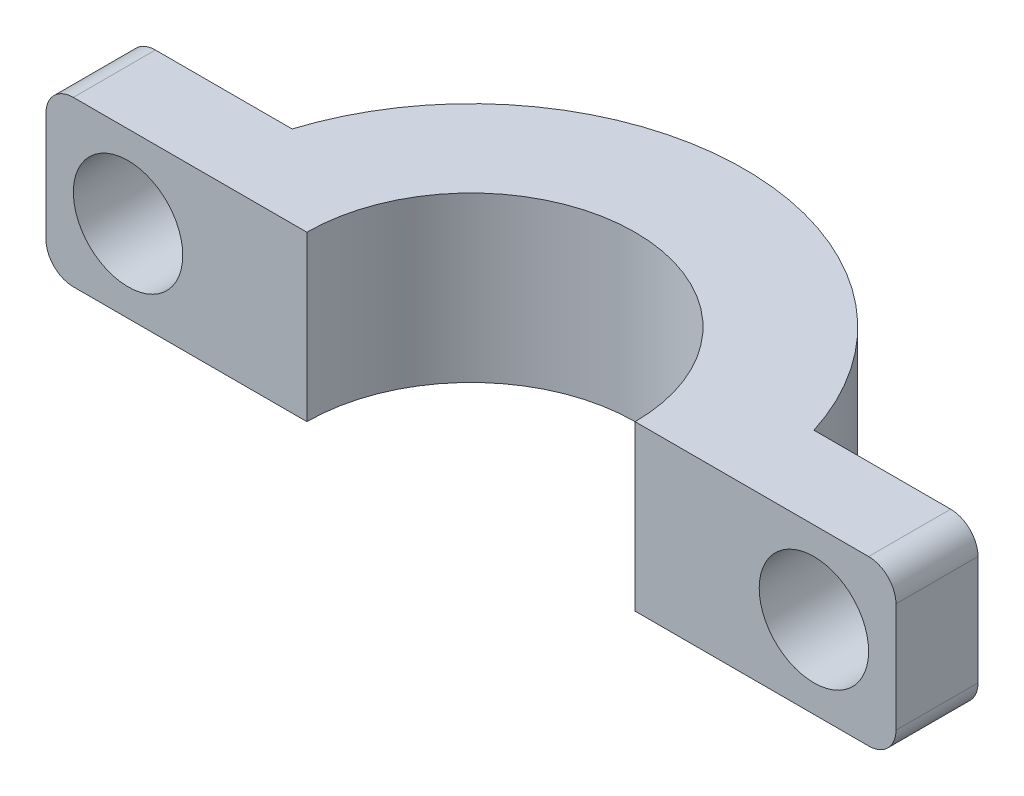
ISO-10303-21;
HEADER;
FILE_DESCRIPTION(('STEP AP214'),'2;1');
FILE_NAME('part.step','',(''),(''),'','','');
FILE_SCHEMA(('AUTOMOTIVE_DESIGN { 1 0 10303 214 1 1 1 1 }'));
ENDSEC;
DATA;
#1=APPLICATION_CONTEXT('core data for automotive mechanical design processes');
#2=APPLICATION_PROTOCOL_DEFINITION('international standard','automotive_design',2000,#1);
#3=PRODUCT_CONTEXT('',#1,'mechanical');
#4=PRODUCT('Part','Part','',(#3));
#5=PRODUCT_RELATED_PRODUCT_CATEGORY('part','',(#4));
#6=PRODUCT_DEFINITION_FORMATION('','',#4);
#7=PRODUCT_DEFINITION_CONTEXT('part definition',#1,'design');
#8=PRODUCT_DEFINITION('design','',#6,#7);
#9=PRODUCT_DEFINITION_SHAPE('','',#8);
#10=(LENGTH_UNIT() NAMED_UNIT(*) SI_UNIT(.MILLI.,.METRE.));
#11=(NAMED_UNIT(*) PLANE_ANGLE_UNIT() SI_UNIT($,.RADIAN.));
#12=(NAMED_UNIT(*) SI_UNIT($,.STERADIAN.) SOLID_ANGLE_UNIT());
#13=UNCERTAINTY_MEASURE_WITH_UNIT(LENGTH_MEASURE(1.E-05),#10,'distance_accuracy_value','');
#14=(GEOMETRIC_REPRESENTATION_CONTEXT(3) GLOBAL_UNCERTAINTY_ASSIGNED_CONTEXT((#13)) GLOBAL_UNIT_ASSIGNED_CONTEXT((#10,
#11,#12)) REPRESENTATION_CONTEXT('',''));
#15=CARTESIAN_POINT('',(0.,0.,0.));
#16=DIRECTION('',(0.,0.,1.));
#17=DIRECTION('',(1.,0.,0.));
#18=AXIS2_PLACEMENT_3D('',#15,#16,#17);
#19=CARTESIAN_POINT('',(0.,6.,0.));
#20=DIRECTION('',(0.,-1.,0.));
#21=DIRECTION('',(0.,0.,-1.));
#22=AXIS2_PLACEMENT_3D('',#19,#20,#21);
#23=CYLINDRICAL_SURFACE('',#22,10.);
#24=DIRECTION('',(0.,1.,0.));
#25=VECTOR('',#24,1.);
#26=CARTESIAN_POINT('',(9.53939201416946,-6.70820393249937,-3.));
#27=LINE('',#26,#25);
#28=CARTESIAN_POINT('',(9.53939201416946,0.,-3.));
#29=VERTEX_POINT('',#28);
#30=CARTESIAN_POINT('',(9.53939201416946,6.,-3.));
#31=VERTEX_POINT('',#30);
#32=EDGE_CURVE('E148',#29,#31,#27,.T.);
#33=ORIENTED_EDGE('',*,*,#32,.F.);
#34=CARTESIAN_POINT('',(0.,0.,0.));
#35=DIRECTION('',(0.,1.,0.));
#36=DIRECTION('',(0.,0.,-1.));
#37=AXIS2_PLACEMENT_3D('',#34,#35,#36);
#38=CIRCLE('',#37,10.);
#39=CARTESIAN_POINT('',(-9.53939201416946,0.,-3.));
#40=VERTEX_POINT('',#39);
#41=EDGE_CURVE('E131',#29,#40,#38,.T.);
#42=ORIENTED_EDGE('',*,*,#41,.T.);
#43=DIRECTION('',(0.,1.,0.));
#44=VECTOR('',#43,1.);
#45=CARTESIAN_POINT('',(-9.53939201416946,-6.70820393249937,-3.));
#46=LINE('',#45,#44);
#47=CARTESIAN_POINT('',(-9.53939201416946,6.,-3.));
#48=VERTEX_POINT('',#47);
#49=EDGE_CURVE('E177',#40,#48,#46,.T.);
#50=ORIENTED_EDGE('',*,*,#49,.T.);
#51=CARTESIAN_POINT('',(0.,6.,0.));
#52=DIRECTION('',(0.,1.,0.));
#53=DIRECTION('',(0.,0.,-1.));
#54=AXIS2_PLACEMENT_3D('',#51,#52,#53);
#55=CIRCLE('',#54,10.);
#56=EDGE_CURVE('E149',#31,#48,#55,.T.);
#57=ORIENTED_EDGE('',*,*,#56,.F.);
#58=EDGE_LOOP('',(#33,#42,#50,#57));
#59=FACE_BOUND('',#58,.T.);
#60=ADVANCED_FACE('F42',(#59),#23,.T.);
#61=CARTESIAN_POINT('',(0.,6.,0.));
#62=DIRECTION('',(0.,-1.,0.));
#63=DIRECTION('',(0.,0.,-1.));
#64=AXIS2_PLACEMENT_3D('',#61,#62,#63);
#65=CYLINDRICAL_SURFACE('',#64,6.);
#66=CARTESIAN_POINT('',(0.,0.,0.));
#67=DIRECTION('',(0.,-1.,0.));
#68=DIRECTION('',(0.,0.,-1.));
#69=AXIS2_PLACEMENT_3D('',#66,#67,#68);
#70=CIRCLE('',#69,6.);
#71=CARTESIAN_POINT('',(-6.,0.,0.));
#72=VERTEX_POINT('',#71);
#73=CARTESIAN_POINT('',(6.,0.,0.));
#74=VERTEX_POINT('',#73);
#75=EDGE_CURVE('E181',#72,#74,#70,.T.);
#76=ORIENTED_EDGE('',*,*,#75,.T.);
#77=DIRECTION('',(0.,-1.,0.));
#78=VECTOR('',#77,1.);
#79=CARTESIAN_POINT('',(6.,6.,0.));
#80=LINE('',#79,#78);
#81=CARTESIAN_POINT('',(6.,6.,0.));
#82=VERTEX_POINT('',#81);
#83=EDGE_CURVE('E199',#82,#74,#80,.T.);
#84=ORIENTED_EDGE('',*,*,#83,.F.);
#85=CARTESIAN_POINT('',(0.,6.,0.));
#86=DIRECTION('',(0.,-1.,0.));
#87=DIRECTION('',(0.,0.,-1.));
#88=AXIS2_PLACEMENT_3D('',#85,#86,#87);
#89=CIRCLE('',#88,6.);
#90=CARTESIAN_POINT('',(-6.,6.,0.));
#91=VERTEX_POINT('',#90);
#92=EDGE_CURVE('E182',#91,#82,#89,.T.);
#93=ORIENTED_EDGE('',*,*,#92,.F.);
#94=DIRECTION('',(0.,-1.,0.));
#95=VECTOR('',#94,1.);
#96=CARTESIAN_POINT('',(-6.,6.,0.));
#97=LINE('',#96,#95);
#98=EDGE_CURVE('E191',#91,#72,#97,.T.);
#99=ORIENTED_EDGE('',*,*,#98,.T.);
#100=EDGE_LOOP('',(#76,#84,#93,#99));
#101=FACE_BOUND('',#100,.T.);
#102=ADVANCED_FACE('F247',(#101),#65,.F.);
#103=CARTESIAN_POINT('',(6.,6.,0.));
#104=DIRECTION('',(0.,0.,-1.));
#105=DIRECTION('',(-1.,0.,0.));
#106=AXIS2_PLACEMENT_3D('',#103,#104,#105);
#107=PLANE('',#106);
#108=CARTESIAN_POINT('',(12.5393920141695,3.,0.));
#109=DIRECTION('',(0.,0.,-1.));
#110=DIRECTION('',(-1.,0.,0.));
#111=AXIS2_PLACEMENT_3D('',#108,#109,#110);
#112=CIRCLE('',#111,2.);
#113=CARTESIAN_POINT('',(10.5393920141695,3.,0.));
#114=VERTEX_POINT('',#113);
#115=EDGE_CURVE('E207',#114,#114,#112,.T.);
#116=ORIENTED_EDGE('',*,*,#115,.T.);
#117=EDGE_LOOP('',(#116));
#118=FACE_BOUND('',#117,.T.);
#119=DIRECTION('',(1.,0.,0.));
#120=VECTOR('',#119,1.);
#121=CARTESIAN_POINT('',(6.,0.,0.));
#122=LINE('',#121,#120);
#123=CARTESIAN_POINT('',(14.5393920141695,0.,0.));
#124=VERTEX_POINT('',#123);
#125=EDGE_CURVE('E145',#74,#124,#122,.T.);
#126=ORIENTED_EDGE('',*,*,#125,.T.);
#127=CARTESIAN_POINT('',(14.5393920141695,1.,0.));
#128=DIRECTION('',(0.,0.,-1.));
#129=DIRECTION('',(-1.,0.,0.));
#130=AXIS2_PLACEMENT_3D('',#127,#128,#129);
#131=CIRCLE('',#130,1.);
#132=CARTESIAN_POINT('',(15.5393920141695,1.,0.));
#133=VERTEX_POINT('',#132);
#134=EDGE_CURVE('E231',#124,#133,#131,.F.);
#135=ORIENTED_EDGE('',*,*,#134,.T.);
#136=DIRECTION('',(0.,1.,0.));
#137=VECTOR('',#136,1.);
#138=CARTESIAN_POINT('',(15.5393920141695,-6.70820393249937,0.));
#139=LINE('',#138,#137);
#140=CARTESIAN_POINT('',(15.5393920141695,5.,0.));
#141=VERTEX_POINT('',#140);
#142=EDGE_CURVE('E157',#133,#141,#139,.T.);
#143=ORIENTED_EDGE('',*,*,#142,.T.);
#144=CARTESIAN_POINT('',(14.5393920141695,5.,0.));
#145=DIRECTION('',(0.,0.,-1.));
#146=DIRECTION('',(-1.,0.,0.));
#147=AXIS2_PLACEMENT_3D('',#144,#145,#146);
#148=CIRCLE('',#147,1.);
#149=CARTESIAN_POINT('',(14.5393920141695,6.,0.));
#150=VERTEX_POINT('',#149);
#151=EDGE_CURVE('E229',#141,#150,#148,.F.);
#152=ORIENTED_EDGE('',*,*,#151,.T.);
#153=DIRECTION('',(1.,0.,0.));
#154=VECTOR('',#153,1.);
#155=CARTESIAN_POINT('',(6.,6.,0.));
#156=LINE('',#155,#154);
#157=EDGE_CURVE('E185',#82,#150,#156,.T.);
#158=ORIENTED_EDGE('',*,*,#157,.F.);
#159=ORIENTED_EDGE('',*,*,#83,.T.);
#160=EDGE_LOOP('',(#126,#135,#143,#152,#158,#159));
#161=FACE_BOUND('',#160,.T.);
#162=ADVANCED_FACE('F240',(#118,#161),#107,.F.);
#163=CARTESIAN_POINT('',(-10.,6.,0.));
#164=DIRECTION('',(0.,0.,-1.));
#165=DIRECTION('',(-1.,0.,0.));
#166=AXIS2_PLACEMENT_3D('',#163,#164,#165);
#167=PLANE('',#166);
#168=CARTESIAN_POINT('',(-12.5393920141695,3.,0.));
#169=DIRECTION('',(0.,0.,1.));
#170=DIRECTION('',(1.,0.,0.));
#171=AXIS2_PLACEMENT_3D('',#168,#169,#170);
#172=CIRCLE('',#171,2.);
#173=CARTESIAN_POINT('',(-10.5393920141695,3.,0.));
#174=VERTEX_POINT('',#173);
#175=EDGE_CURVE('E156',#174,#174,#172,.T.);
#176=ORIENTED_EDGE('',*,*,#175,.F.);
#177=EDGE_LOOP('',(#176));
#178=FACE_BOUND('',#177,.T.);
#179=DIRECTION('',(0.,1.,0.));
#180=VECTOR('',#179,1.);
#181=CARTESIAN_POINT('',(-15.5393920141695,-6.70820393249937,0.));
#182=LINE('',#181,#180);
#183=CARTESIAN_POINT('',(-15.5393920141695,1.,0.));
#184=VERTEX_POINT('',#183);
#185=CARTESIAN_POINT('',(-15.5393920141695,5.,0.));
#186=VERTEX_POINT('',#185);
#187=EDGE_CURVE('E174',#184,#186,#182,.T.);
#188=ORIENTED_EDGE('',*,*,#187,.F.);
#189=CARTESIAN_POINT('',(-14.5393920141695,1.,0.));
#190=DIRECTION('',(0.,0.,-1.));
#191=DIRECTION('',(-1.,0.,0.));
#192=AXIS2_PLACEMENT_3D('',#189,#190,#191);
#193=CIRCLE('',#192,1.);
#194=CARTESIAN_POINT('',(-14.5393920141695,0.,0.));
#195=VERTEX_POINT('',#194);
#196=EDGE_CURVE('E214',#184,#195,#193,.F.);
#197=ORIENTED_EDGE('',*,*,#196,.T.);
#198=DIRECTION('',(1.,0.,0.));
#199=VECTOR('',#198,1.);
#200=CARTESIAN_POINT('',(-10.,0.,0.));
#201=LINE('',#200,#199);
#202=EDGE_CURVE('E144',#195,#72,#201,.T.);
#203=ORIENTED_EDGE('',*,*,#202,.T.);
#204=ORIENTED_EDGE('',*,*,#98,.F.);
#205=DIRECTION('',(1.,0.,0.));
#206=VECTOR('',#205,1.);
#207=CARTESIAN_POINT('',(-10.,6.,0.));
#208=LINE('',#207,#206);
#209=CARTESIAN_POINT('',(-14.5393920141695,6.,0.));
#210=VERTEX_POINT('',#209);
#211=EDGE_CURVE('E189',#210,#91,#208,.T.);
#212=ORIENTED_EDGE('',*,*,#211,.F.);
#213=CARTESIAN_POINT('',(-14.5393920141695,5.,0.));
#214=DIRECTION('',(0.,0.,-1.));
#215=DIRECTION('',(-1.,0.,0.));
#216=AXIS2_PLACEMENT_3D('',#213,#214,#215);
#217=CIRCLE('',#216,1.);
#218=EDGE_CURVE('E212',#210,#186,#217,.F.);
#219=ORIENTED_EDGE('',*,*,#218,.T.);
#220=EDGE_LOOP('',(#188,#197,#203,#204,#212,#219));
#221=FACE_BOUND('',#220,.T.);
#222=ADVANCED_FACE('F252',(#178,#221),#167,.F.);
#223=CARTESIAN_POINT('',(0.,6.,0.));
#224=DIRECTION('',(0.,-1.,0.));
#225=DIRECTION('',(0.,0.,-1.));
#226=AXIS2_PLACEMENT_3D('',#223,#224,#225);
#227=PLANE('',#226);
#228=DIRECTION('',(-1.,0.,0.));
#229=VECTOR('',#228,1.);
#230=CARTESIAN_POINT('',(-15.5393920141695,6.,-3.));
#231=LINE('',#230,#229);
#232=CARTESIAN_POINT('',(-14.5393920141695,6.,-3.));
#233=VERTEX_POINT('',#232);
#234=EDGE_CURVE('E169',#48,#233,#231,.T.);
#235=ORIENTED_EDGE('',*,*,#234,.T.);
#236=DIRECTION('',(0.,0.,1.));
#237=VECTOR('',#236,1.);
#238=CARTESIAN_POINT('',(-14.5393920141695,6.,0.));
#239=LINE('',#238,#237);
#240=EDGE_CURVE('E226',#233,#210,#239,.T.);
#241=ORIENTED_EDGE('',*,*,#240,.T.);
#242=ORIENTED_EDGE('',*,*,#211,.T.);
#243=ORIENTED_EDGE('',*,*,#92,.T.);
#244=ORIENTED_EDGE('',*,*,#157,.T.);
#245=DIRECTION('',(0.,0.,1.));
#246=VECTOR('',#245,1.);
#247=CARTESIAN_POINT('',(14.5393920141695,6.,0.));
#248=LINE('',#247,#246);
#249=CARTESIAN_POINT('',(14.5393920141695,6.,-3.));
#250=VERTEX_POINT('',#249);
#251=EDGE_CURVE('E224',#150,#250,#248,.F.);
#252=ORIENTED_EDGE('',*,*,#251,.T.);
#253=DIRECTION('',(1.,0.,0.));
#254=VECTOR('',#253,1.);
#255=CARTESIAN_POINT('',(15.5393920141695,6.,-3.));
#256=LINE('',#255,#254);
#257=EDGE_CURVE('E151',#31,#250,#256,.T.);
#258=ORIENTED_EDGE('',*,*,#257,.F.);
#259=ORIENTED_EDGE('',*,*,#56,.T.);
#260=EDGE_LOOP('',(#235,#241,#242,#243,#244,#252,#258,#259));
#261=FACE_BOUND('',#260,.T.);
#262=ADVANCED_FACE('F270',(#261),#227,.F.);
#263=CARTESIAN_POINT('',(0.,0.,0.));
#264=DIRECTION('',(0.,-1.,0.));
#265=DIRECTION('',(0.,0.,-1.));
#266=AXIS2_PLACEMENT_3D('',#263,#264,#265);
#267=PLANE('',#266);
#268=ORIENTED_EDGE('',*,*,#202,.F.);
#269=DIRECTION('',(0.,0.,1.));
#270=VECTOR('',#269,1.);
#271=CARTESIAN_POINT('',(-14.5393920141695,0.,0.));
#272=LINE('',#271,#270);
#273=CARTESIAN_POINT('',(-14.5393920141695,0.,-3.));
#274=VERTEX_POINT('',#273);
#275=EDGE_CURVE('E218',#195,#274,#272,.F.);
#276=ORIENTED_EDGE('',*,*,#275,.T.);
#277=DIRECTION('',(-1.,0.,0.));
#278=VECTOR('',#277,1.);
#279=CARTESIAN_POINT('',(-15.5393920141695,0.,-3.));
#280=LINE('',#279,#278);
#281=EDGE_CURVE('E140',#40,#274,#280,.T.);
#282=ORIENTED_EDGE('',*,*,#281,.F.);
#283=ORIENTED_EDGE('',*,*,#41,.F.);
#284=DIRECTION('',(1.,0.,0.));
#285=VECTOR('',#284,1.);
#286=CARTESIAN_POINT('',(15.5393920141695,0.,-3.));
#287=LINE('',#286,#285);
#288=CARTESIAN_POINT('',(14.5393920141695,0.,-3.));
#289=VERTEX_POINT('',#288);
#290=EDGE_CURVE('E137',#29,#289,#287,.T.);
#291=ORIENTED_EDGE('',*,*,#290,.T.);
#292=DIRECTION('',(0.,0.,1.));
#293=VECTOR('',#292,1.);
#294=CARTESIAN_POINT('',(14.5393920141695,0.,0.));
#295=LINE('',#294,#293);
#296=EDGE_CURVE('E216',#289,#124,#295,.T.);
#297=ORIENTED_EDGE('',*,*,#296,.T.);
#298=ORIENTED_EDGE('',*,*,#125,.F.);
#299=ORIENTED_EDGE('',*,*,#75,.F.);
#300=EDGE_LOOP('',(#268,#276,#282,#283,#291,#297,#298,#299));
#301=FACE_BOUND('',#300,.T.);
#302=ADVANCED_FACE('F134',(#301),#267,.T.);
#303=CARTESIAN_POINT('',(-15.5393920141695,-6.70820393249937,-3.));
#304=DIRECTION('',(0.,0.,-1.));
#305=DIRECTION('',(-1.,0.,0.));
#306=AXIS2_PLACEMENT_3D('',#303,#304,#305);
#307=PLANE('',#306);
#308=CARTESIAN_POINT('',(-12.5393920141695,3.,-3.));
#309=DIRECTION('',(0.,0.,-1.));
#310=DIRECTION('',(-1.,0.,0.));
#311=AXIS2_PLACEMENT_3D('',#308,#309,#310);
#312=CIRCLE('',#311,2.);
#313=CARTESIAN_POINT('',(-14.5393920141695,3.,-3.));
#314=VERTEX_POINT('',#313);
#315=EDGE_CURVE('E160',#314,#314,#312,.T.);
#316=ORIENTED_EDGE('',*,*,#315,.F.);
#317=EDGE_LOOP('',(#316));
#318=FACE_BOUND('',#317,.T.);
#319=ORIENTED_EDGE('',*,*,#281,.T.);
#320=CARTESIAN_POINT('',(-14.5393920141695,1.,-3.));
#321=DIRECTION('',(0.,0.,-1.));
#322=DIRECTION('',(-1.,0.,0.));
#323=AXIS2_PLACEMENT_3D('',#320,#321,#322);
#324=CIRCLE('',#323,1.);
#325=CARTESIAN_POINT('',(-15.5393920141695,1.,-3.));
#326=VERTEX_POINT('',#325);
#327=EDGE_CURVE('E222',#274,#326,#324,.T.);
#328=ORIENTED_EDGE('',*,*,#327,.T.);
#329=DIRECTION('',(0.,1.,0.));
#330=VECTOR('',#329,1.);
#331=CARTESIAN_POINT('',(-15.5393920141695,-6.70820393249937,-3.));
#332=LINE('',#331,#330);
#333=CARTESIAN_POINT('',(-15.5393920141695,5.,-3.));
#334=VERTEX_POINT('',#333);
#335=EDGE_CURVE('E173',#326,#334,#332,.T.);
#336=ORIENTED_EDGE('',*,*,#335,.T.);
#337=CARTESIAN_POINT('',(-14.5393920141695,5.,-3.));
#338=DIRECTION('',(0.,0.,-1.));
#339=DIRECTION('',(-1.,0.,0.));
#340=AXIS2_PLACEMENT_3D('',#337,#338,#339);
#341=CIRCLE('',#340,1.);
#342=EDGE_CURVE('E220',#334,#233,#341,.T.);
#343=ORIENTED_EDGE('',*,*,#342,.T.);
#344=ORIENTED_EDGE('',*,*,#234,.F.);
#345=ORIENTED_EDGE('',*,*,#49,.F.);
#346=EDGE_LOOP('',(#319,#328,#336,#343,#344,#345));
#347=FACE_BOUND('',#346,.T.);
#348=ADVANCED_FACE('F260',(#318,#347),#307,.T.);
#349=CARTESIAN_POINT('',(-15.5393920141695,-6.70820393249937,0.));
#350=DIRECTION('',(-1.,0.,0.));
#351=DIRECTION('',(0.,0.,1.));
#352=AXIS2_PLACEMENT_3D('',#349,#350,#351);
#353=PLANE('',#352);
#354=ORIENTED_EDGE('',*,*,#335,.F.);
#355=DIRECTION('',(0.,0.,1.));
#356=VECTOR('',#355,1.);
#357=CARTESIAN_POINT('',(-15.5393920141695,1.,0.));
#358=LINE('',#357,#356);
#359=EDGE_CURVE('E209',#326,#184,#358,.T.);
#360=ORIENTED_EDGE('',*,*,#359,.T.);
#361=ORIENTED_EDGE('',*,*,#187,.T.);
#362=DIRECTION('',(0.,0.,1.));
#363=VECTOR('',#362,1.);
#364=CARTESIAN_POINT('',(-15.5393920141695,5.,-3.));
#365=LINE('',#364,#363);
#366=EDGE_CURVE('E202',#186,#334,#365,.F.);
#367=ORIENTED_EDGE('',*,*,#366,.T.);
#368=EDGE_LOOP('',(#354,#360,#361,#367));
#369=FACE_BOUND('',#368,.T.);
#370=ADVANCED_FACE('F263',(#369),#353,.T.);
#371=CARTESIAN_POINT('',(-12.5393920141695,3.,-10.));
#372=DIRECTION('',(0.,0.,1.));
#373=DIRECTION('',(1.,0.,0.));
#374=AXIS2_PLACEMENT_3D('',#371,#372,#373);
#375=CYLINDRICAL_SURFACE('',#374,2.);
#376=ORIENTED_EDGE('',*,*,#315,.T.);
#377=EDGE_LOOP('',(#376));
#378=FACE_BOUND('',#377,.T.);
#379=ORIENTED_EDGE('',*,*,#175,.T.);
#380=EDGE_LOOP('',(#379));
#381=FACE_BOUND('',#380,.T.);
#382=ADVANCED_FACE('F359',(#378,#381),#375,.F.);
#383=CARTESIAN_POINT('',(15.5393920141695,-6.70820393249937,-3.));
#384=DIRECTION('',(0.,0.,1.));
#385=DIRECTION('',(1.,0.,0.));
#386=AXIS2_PLACEMENT_3D('',#383,#384,#385);
#387=PLANE('',#386);
#388=CARTESIAN_POINT('',(12.5393920141695,3.,-3.));
#389=DIRECTION('',(0.,0.,1.));
#390=DIRECTION('',(1.,0.,0.));
#391=AXIS2_PLACEMENT_3D('',#388,#389,#390);
#392=CIRCLE('',#391,2.);
#393=CARTESIAN_POINT('',(14.5393920141695,3.,-3.));
#394=VERTEX_POINT('',#393);
#395=EDGE_CURVE('E152',#394,#394,#392,.F.);
#396=ORIENTED_EDGE('',*,*,#395,.F.);
#397=EDGE_LOOP('',(#396));
#398=FACE_BOUND('',#397,.T.);
#399=DIRECTION('',(0.,1.,0.));
#400=VECTOR('',#399,1.);
#401=CARTESIAN_POINT('',(15.5393920141695,-6.70820393249937,-3.));
#402=LINE('',#401,#400);
#403=CARTESIAN_POINT('',(15.5393920141695,1.,-3.));
#404=VERTEX_POINT('',#403);
#405=CARTESIAN_POINT('',(15.5393920141695,5.,-3.));
#406=VERTEX_POINT('',#405);
#407=EDGE_CURVE('E163',#404,#406,#402,.T.);
#408=ORIENTED_EDGE('',*,*,#407,.F.);
#409=CARTESIAN_POINT('',(14.5393920141695,1.,-3.));
#410=DIRECTION('',(0.,0.,1.));
#411=DIRECTION('',(1.,0.,0.));
#412=AXIS2_PLACEMENT_3D('',#409,#410,#411);
#413=CIRCLE('',#412,1.);
#414=EDGE_CURVE('E12',#404,#289,#413,.F.);
#415=ORIENTED_EDGE('',*,*,#414,.T.);
#416=ORIENTED_EDGE('',*,*,#290,.F.);
#417=ORIENTED_EDGE('',*,*,#32,.T.);
#418=ORIENTED_EDGE('',*,*,#257,.T.);
#419=CARTESIAN_POINT('',(14.5393920141695,5.,-3.));
#420=DIRECTION('',(0.,0.,1.));
#421=DIRECTION('',(1.,0.,0.));
#422=AXIS2_PLACEMENT_3D('',#419,#420,#421);
#423=CIRCLE('',#422,1.);
#424=EDGE_CURVE('E50',#250,#406,#423,.F.);
#425=ORIENTED_EDGE('',*,*,#424,.T.);
#426=EDGE_LOOP('',(#408,#415,#416,#417,#418,#425));
#427=FACE_BOUND('',#426,.T.);
#428=ADVANCED_FACE('F154',(#398,#427),#387,.F.);
#429=CARTESIAN_POINT('',(15.5393920141695,-6.70820393249937,0.));
#430=DIRECTION('',(-1.,0.,0.));
#431=DIRECTION('',(0.,0.,1.));
#432=AXIS2_PLACEMENT_3D('',#429,#430,#431);
#433=PLANE('',#432);
#434=ORIENTED_EDGE('',*,*,#142,.F.);
#435=DIRECTION('',(0.,0.,1.));
#436=VECTOR('',#435,1.);
#437=CARTESIAN_POINT('',(15.5393920141695,1.,-3.));
#438=LINE('',#437,#436);
#439=EDGE_CURVE('E63',#133,#404,#438,.F.);
#440=ORIENTED_EDGE('',*,*,#439,.T.);
#441=ORIENTED_EDGE('',*,*,#407,.T.);
#442=DIRECTION('',(0.,0.,1.));
#443=VECTOR('',#442,1.);
#444=CARTESIAN_POINT('',(15.5393920141695,5.,0.));
#445=LINE('',#444,#443);
#446=EDGE_CURVE('E233',#406,#141,#445,.T.);
#447=ORIENTED_EDGE('',*,*,#446,.T.);
#448=EDGE_LOOP('',(#434,#440,#441,#447));
#449=FACE_BOUND('',#448,.T.);
#450=ADVANCED_FACE('F237',(#449),#433,.F.);
#451=CARTESIAN_POINT('',(12.5393920141695,3.,-10.));
#452=DIRECTION('',(0.,0.,1.));
#453=DIRECTION('',(1.,0.,0.));
#454=AXIS2_PLACEMENT_3D('',#451,#452,#453);
#455=CYLINDRICAL_SURFACE('',#454,2.);
#456=ORIENTED_EDGE('',*,*,#115,.F.);
#457=EDGE_LOOP('',(#456));
#458=FACE_BOUND('',#457,.T.);
#459=ORIENTED_EDGE('',*,*,#395,.T.);
#460=EDGE_LOOP('',(#459));
#461=FACE_BOUND('',#460,.T.);
#462=ADVANCED_FACE('F290',(#458,#461),#455,.F.);
#463=CARTESIAN_POINT('',(-14.5393920141695,1.,0.));
#464=DIRECTION('',(0.,0.,1.));
#465=DIRECTION('',(1.,0.,0.));
#466=AXIS2_PLACEMENT_3D('',#463,#464,#465);
#467=CYLINDRICAL_SURFACE('',#466,1.);
#468=ORIENTED_EDGE('',*,*,#327,.F.);
#469=ORIENTED_EDGE('',*,*,#275,.F.);
#470=ORIENTED_EDGE('',*,*,#196,.F.);
#471=ORIENTED_EDGE('',*,*,#359,.F.);
#472=EDGE_LOOP('',(#468,#469,#470,#471));
#473=FACE_BOUND('',#472,.T.);
#474=ADVANCED_FACE('F256',(#473),#467,.T.);
#475=CARTESIAN_POINT('',(-14.5393920141695,5.,0.));
#476=DIRECTION('',(0.,0.,-1.));
#477=DIRECTION('',(-1.,0.,0.));
#478=AXIS2_PLACEMENT_3D('',#475,#476,#477);
#479=CYLINDRICAL_SURFACE('',#478,1.);
#480=ORIENTED_EDGE('',*,*,#342,.F.);
#481=ORIENTED_EDGE('',*,*,#366,.F.);
#482=ORIENTED_EDGE('',*,*,#218,.F.);
#483=ORIENTED_EDGE('',*,*,#240,.F.);
#484=EDGE_LOOP('',(#480,#481,#482,#483));
#485=FACE_BOUND('',#484,.T.);
#486=ADVANCED_FACE('F266',(#485),#479,.T.);
#487=CARTESIAN_POINT('',(14.5393920141695,1.,0.));
#488=DIRECTION('',(0.,0.,-1.));
#489=DIRECTION('',(-1.,0.,0.));
#490=AXIS2_PLACEMENT_3D('',#487,#488,#489);
#491=CYLINDRICAL_SURFACE('',#490,1.);
#492=ORIENTED_EDGE('',*,*,#414,.F.);
#493=ORIENTED_EDGE('',*,*,#439,.F.);
#494=ORIENTED_EDGE('',*,*,#134,.F.);
#495=ORIENTED_EDGE('',*,*,#296,.F.);
#496=EDGE_LOOP('',(#492,#493,#494,#495));
#497=FACE_BOUND('',#496,.T.);
#498=ADVANCED_FACE('F242',(#497),#491,.T.);
#499=CARTESIAN_POINT('',(14.5393920141695,5.,0.));
#500=DIRECTION('',(0.,0.,1.));
#501=DIRECTION('',(1.,0.,0.));
#502=AXIS2_PLACEMENT_3D('',#499,#500,#501);
#503=CYLINDRICAL_SURFACE('',#502,1.);
#504=ORIENTED_EDGE('',*,*,#424,.F.);
#505=ORIENTED_EDGE('',*,*,#251,.F.);
#506=ORIENTED_EDGE('',*,*,#151,.F.);
#507=ORIENTED_EDGE('',*,*,#446,.F.);
#508=EDGE_LOOP('',(#504,#505,#506,#507));
#509=FACE_BOUND('',#508,.T.);
#510=ADVANCED_FACE('F44',(#509),#503,.T.);
#511=CLOSED_SHELL('',(#60,#102,#162,#222,#262,#302,#348,#370,#382,#428,#450,#462,#474,#486,#498,#510));
#512=MANIFOLD_SOLID_BREP('B2',#511);
#513=ADVANCED_BREP_SHAPE_REPRESENTATION('',(#18,#512),#14);
#514=SHAPE_DEFINITION_REPRESENTATION(#9,#513);
ENDSEC;
END-ISO-10303-21;
